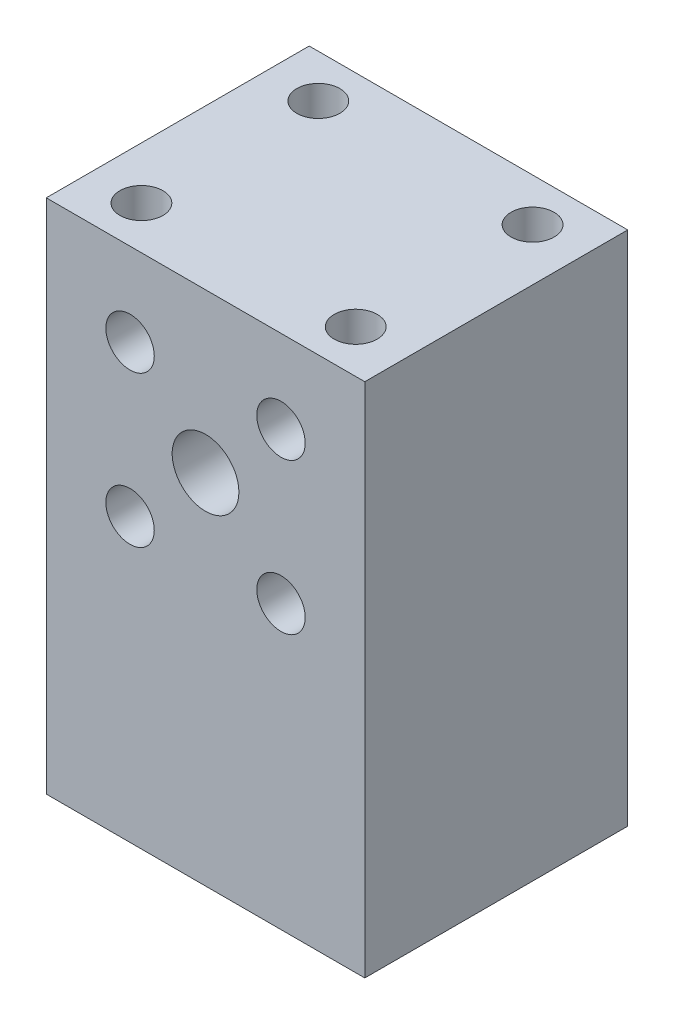
ISO-10303-21;
HEADER;
FILE_DESCRIPTION(('STEP AP214'),'2;1');
FILE_NAME('part.step','',(''),(''),'','','');
FILE_SCHEMA(('AUTOMOTIVE_DESIGN { 1 0 10303 214 1 1 1 1 }'));
ENDSEC;
DATA;
#1=APPLICATION_CONTEXT('core data for automotive mechanical design processes');
#2=APPLICATION_PROTOCOL_DEFINITION('international standard','automotive_design',2000,#1);
#3=PRODUCT_CONTEXT('',#1,'mechanical');
#4=PRODUCT('Part','Part','',(#3));
#5=PRODUCT_RELATED_PRODUCT_CATEGORY('part','',(#4));
#6=PRODUCT_DEFINITION_FORMATION('','',#4);
#7=PRODUCT_DEFINITION_CONTEXT('part definition',#1,'design');
#8=PRODUCT_DEFINITION('design','',#6,#7);
#9=PRODUCT_DEFINITION_SHAPE('','',#8);
#10=(LENGTH_UNIT() NAMED_UNIT(*) SI_UNIT(.MILLI.,.METRE.));
#11=(NAMED_UNIT(*) PLANE_ANGLE_UNIT() SI_UNIT($,.RADIAN.));
#12=(NAMED_UNIT(*) SI_UNIT($,.STERADIAN.) SOLID_ANGLE_UNIT());
#13=UNCERTAINTY_MEASURE_WITH_UNIT(LENGTH_MEASURE(1.E-05),#10,'distance_accuracy_value','');
#14=(GEOMETRIC_REPRESENTATION_CONTEXT(3) GLOBAL_UNCERTAINTY_ASSIGNED_CONTEXT((#13)) GLOBAL_UNIT_ASSIGNED_CONTEXT((#10,
#11,#12)) REPRESENTATION_CONTEXT('',''));
#15=CARTESIAN_POINT('',(0.,0.,0.));
#16=DIRECTION('',(0.,0.,1.));
#17=DIRECTION('',(1.,0.,0.));
#18=AXIS2_PLACEMENT_3D('',#15,#16,#17);
#19=CARTESIAN_POINT('',(23.4999999999754,52.8073925901338,-38.8000000000008));
#20=DIRECTION('',(0.,0.,1.));
#21=DIRECTION('',(1.,0.,0.));
#22=AXIS2_PLACEMENT_3D('',#19,#20,#21);
#23=CYLINDRICAL_SURFACE('',#22,4.92125);
#24=CARTESIAN_POINT('',(23.4999999999754,52.8073925901338,0.));
#25=DIRECTION('',(0.,0.,1.));
#26=DIRECTION('',(1.,0.,0.));
#27=AXIS2_PLACEMENT_3D('',#24,#25,#26);
#28=CIRCLE('',#27,4.92125);
#29=CARTESIAN_POINT('',(28.4212499999754,52.8073925901338,0.));
#30=VERTEX_POINT('',#29);
#31=EDGE_CURVE('E147',#30,#30,#28,.T.);
#32=ORIENTED_EDGE('',*,*,#31,.T.);
#33=EDGE_LOOP('',(#32));
#34=FACE_BOUND('',#33,.T.);
#35=CARTESIAN_POINT('',(23.4999999999754,52.8073925901338,-17.7814999999999));
#36=DIRECTION('',(0.,0.,-1.));
#37=DIRECTION('',(-1.,0.,0.));
#38=AXIS2_PLACEMENT_3D('',#35,#36,#37);
#39=CIRCLE('',#38,4.92125);
#40=CARTESIAN_POINT('',(18.5787499999754,52.8073925901338,-17.7814999999999));
#41=VERTEX_POINT('',#40);
#42=EDGE_CURVE('E44',#41,#41,#39,.F.);
#43=ORIENTED_EDGE('',*,*,#42,.F.);
#44=EDGE_LOOP('',(#43));
#45=FACE_BOUND('',#44,.T.);
#46=ADVANCED_FACE('F40',(#34,#45),#23,.F.);
#47=CARTESIAN_POINT('',(0.,76.2,0.));
#48=DIRECTION('',(1.,0.,0.));
#49=DIRECTION('',(0.,0.,-1.));
#50=AXIS2_PLACEMENT_3D('',#47,#48,#49);
#51=PLANE('',#50);
#52=DIRECTION('',(0.,0.,1.));
#53=VECTOR('',#52,1.);
#54=CARTESIAN_POINT('',(0.,0.,0.));
#55=LINE('',#54,#53);
#56=CARTESIAN_POINT('',(0.,0.,-38.7999999999999));
#57=VERTEX_POINT('',#56);
#58=CARTESIAN_POINT('',(0.,0.,0.));
#59=VERTEX_POINT('',#58);
#60=EDGE_CURVE('E111',#57,#59,#55,.T.);
#61=ORIENTED_EDGE('',*,*,#60,.T.);
#62=DIRECTION('',(0.,-1.,0.));
#63=VECTOR('',#62,1.);
#64=CARTESIAN_POINT('',(0.,76.2,0.));
#65=LINE('',#64,#63);
#66=CARTESIAN_POINT('',(0.,76.2,0.));
#67=VERTEX_POINT('',#66);
#68=EDGE_CURVE('E11',#67,#59,#65,.T.);
#69=ORIENTED_EDGE('',*,*,#68,.F.);
#70=DIRECTION('',(0.,0.,1.));
#71=VECTOR('',#70,1.);
#72=CARTESIAN_POINT('',(0.,76.2,0.));
#73=LINE('',#72,#71);
#74=CARTESIAN_POINT('',(0.,76.2,-38.7999999999999));
#75=VERTEX_POINT('',#74);
#76=EDGE_CURVE('E92',#75,#67,#73,.T.);
#77=ORIENTED_EDGE('',*,*,#76,.F.);
#78=DIRECTION('',(0.,-1.,0.));
#79=VECTOR('',#78,1.);
#80=CARTESIAN_POINT('',(0.,76.2,-38.7999999999999));
#81=LINE('',#80,#79);
#82=EDGE_CURVE('E59',#75,#57,#81,.T.);
#83=ORIENTED_EDGE('',*,*,#82,.T.);
#84=EDGE_LOOP('',(#61,#69,#77,#83));
#85=FACE_BOUND('',#84,.T.);
#86=ADVANCED_FACE('F42',(#85),#51,.F.);
#87=CARTESIAN_POINT('',(0.,76.2,0.));
#88=DIRECTION('',(0.,0.,-1.));
#89=DIRECTION('',(-1.,0.,0.));
#90=AXIS2_PLACEMENT_3D('',#87,#88,#89);
#91=PLANE('',#90);
#92=CARTESIAN_POINT('',(12.3644824098609,41.671875000008,0.));
#93=DIRECTION('',(0.,0.,1.));
#94=DIRECTION('',(1.,0.,0.));
#95=AXIS2_PLACEMENT_3D('',#92,#93,#94);
#96=CIRCLE('',#95,3.57187499999999);
#97=CARTESIAN_POINT('',(15.9363574098609,41.671875000008,0.));
#98=VERTEX_POINT('',#97);
#99=EDGE_CURVE('E138',#98,#98,#96,.T.);
#100=ORIENTED_EDGE('',*,*,#99,.F.);
#101=EDGE_LOOP('',(#100));
#102=FACE_BOUND('',#101,.T.);
#103=ORIENTED_EDGE('',*,*,#31,.F.);
#104=EDGE_LOOP('',(#103));
#105=FACE_BOUND('',#104,.T.);
#106=CARTESIAN_POINT('',(34.6355175900983,41.6718750000224,0.));
#107=DIRECTION('',(0.,0.,1.));
#108=DIRECTION('',(1.,0.,0.));
#109=AXIS2_PLACEMENT_3D('',#106,#107,#108);
#110=CIRCLE('',#109,3.57187500000001);
#111=CARTESIAN_POINT('',(38.2073925900983,41.6718750000224,0.));
#112=VERTEX_POINT('',#111);
#113=EDGE_CURVE('E151',#112,#112,#110,.T.);
#114=ORIENTED_EDGE('',*,*,#113,.F.);
#115=EDGE_LOOP('',(#114));
#116=FACE_BOUND('',#115,.T.);
#117=CARTESIAN_POINT('',(34.6355175900839,63.9429101802595,0.));
#118=DIRECTION('',(0.,0.,1.));
#119=DIRECTION('',(1.,0.,0.));
#120=AXIS2_PLACEMENT_3D('',#117,#118,#119);
#121=CIRCLE('',#120,3.57187499999999);
#122=CARTESIAN_POINT('',(38.2073925900839,63.9429101802595,0.));
#123=VERTEX_POINT('',#122);
#124=EDGE_CURVE('E159',#123,#123,#121,.T.);
#125=ORIENTED_EDGE('',*,*,#124,.F.);
#126=EDGE_LOOP('',(#125));
#127=FACE_BOUND('',#126,.T.);
#128=CARTESIAN_POINT('',(12.3644824098466,63.9429101802452,0.));
#129=DIRECTION('',(0.,0.,1.));
#130=DIRECTION('',(1.,0.,0.));
#131=AXIS2_PLACEMENT_3D('',#128,#129,#130);
#132=CIRCLE('',#131,3.57187500000001);
#133=CARTESIAN_POINT('',(15.9363574098466,63.9429101802452,0.));
#134=VERTEX_POINT('',#133);
#135=EDGE_CURVE('E130',#134,#134,#132,.T.);
#136=ORIENTED_EDGE('',*,*,#135,.F.);
#137=EDGE_LOOP('',(#136));
#138=FACE_BOUND('',#137,.T.);
#139=DIRECTION('',(1.,0.,0.));
#140=VECTOR('',#139,1.);
#141=CARTESIAN_POINT('',(0.,0.,0.));
#142=LINE('',#141,#140);
#143=CARTESIAN_POINT('',(47.0000000000011,0.,0.));
#144=VERTEX_POINT('',#143);
#145=EDGE_CURVE('E98',#59,#144,#142,.T.);
#146=ORIENTED_EDGE('',*,*,#145,.T.);
#147=DIRECTION('',(0.,-1.,0.));
#148=VECTOR('',#147,1.);
#149=CARTESIAN_POINT('',(47.0000000000011,76.2,0.));
#150=LINE('',#149,#148);
#151=CARTESIAN_POINT('',(47.0000000000011,76.2,0.));
#152=VERTEX_POINT('',#151);
#153=EDGE_CURVE('E51',#152,#144,#150,.T.);
#154=ORIENTED_EDGE('',*,*,#153,.F.);
#155=DIRECTION('',(1.,0.,0.));
#156=VECTOR('',#155,1.);
#157=CARTESIAN_POINT('',(0.,76.2,0.));
#158=LINE('',#157,#156);
#159=EDGE_CURVE('E85',#67,#152,#158,.T.);
#160=ORIENTED_EDGE('',*,*,#159,.F.);
#161=ORIENTED_EDGE('',*,*,#68,.T.);
#162=EDGE_LOOP('',(#146,#154,#160,#161));
#163=FACE_BOUND('',#162,.T.);
#164=ADVANCED_FACE('F97',(#102,#105,#116,#127,#138,#163),#91,.F.);
#165=CARTESIAN_POINT('',(47.0000000000011,76.2,0.));
#166=DIRECTION('',(-1.,0.,0.));
#167=DIRECTION('',(0.,0.,1.));
#168=AXIS2_PLACEMENT_3D('',#165,#166,#167);
#169=PLANE('',#168);
#170=DIRECTION('',(0.,0.,-1.));
#171=VECTOR('',#170,1.);
#172=CARTESIAN_POINT('',(47.0000000000011,0.,0.));
#173=LINE('',#172,#171);
#174=CARTESIAN_POINT('',(47.0000000000011,0.,-38.8000000000008));
#175=VERTEX_POINT('',#174);
#176=EDGE_CURVE('E117',#144,#175,#173,.T.);
#177=ORIENTED_EDGE('',*,*,#176,.T.);
#178=DIRECTION('',(0.,-1.,0.));
#179=VECTOR('',#178,1.);
#180=CARTESIAN_POINT('',(47.0000000000011,76.2,-38.8000000000008));
#181=LINE('',#180,#179);
#182=CARTESIAN_POINT('',(47.0000000000011,76.2,-38.8000000000008));
#183=VERTEX_POINT('',#182);
#184=EDGE_CURVE('E74',#183,#175,#181,.T.);
#185=ORIENTED_EDGE('',*,*,#184,.F.);
#186=DIRECTION('',(0.,0.,-1.));
#187=VECTOR('',#186,1.);
#188=CARTESIAN_POINT('',(47.0000000000011,76.2,0.));
#189=LINE('',#188,#187);
#190=EDGE_CURVE('E91',#152,#183,#189,.T.);
#191=ORIENTED_EDGE('',*,*,#190,.F.);
#192=ORIENTED_EDGE('',*,*,#153,.T.);
#193=EDGE_LOOP('',(#177,#185,#191,#192));
#194=FACE_BOUND('',#193,.T.);
#195=ADVANCED_FACE('F103',(#194),#169,.F.);
#196=CARTESIAN_POINT('',(0.,76.2,-38.7999999999999));
#197=DIRECTION('',(0.,0.,-1.));
#198=DIRECTION('',(-1.,0.,0.));
#199=AXIS2_PLACEMENT_3D('',#196,#197,#198);
#200=PLANE('',#199);
#201=CARTESIAN_POINT('',(23.4999999999754,52.8073925901338,-38.7999999999999));
#202=DIRECTION('',(0.,0.,-1.));
#203=DIRECTION('',(-1.,0.,0.));
#204=AXIS2_PLACEMENT_3D('',#201,#202,#203);
#205=CIRCLE('',#204,9.525);
#206=CARTESIAN_POINT('',(13.9749999999754,52.8073925901338,-38.7999999999999));
#207=VERTEX_POINT('',#206);
#208=EDGE_CURVE('E197',#207,#207,#205,.T.);
#209=ORIENTED_EDGE('',*,*,#208,.F.);
#210=EDGE_LOOP('',(#209));
#211=FACE_BOUND('',#210,.T.);
#212=CARTESIAN_POINT('',(12.3644824098609,41.671875000008,-38.8000000000008));
#213=DIRECTION('',(0.,0.,1.));
#214=DIRECTION('',(1.,0.,0.));
#215=AXIS2_PLACEMENT_3D('',#212,#213,#214);
#216=CIRCLE('',#215,3.57187499999999);
#217=CARTESIAN_POINT('',(15.9363574098609,41.671875000008,-38.8000000000008));
#218=VERTEX_POINT('',#217);
#219=EDGE_CURVE('E142',#218,#218,#216,.T.);
#220=ORIENTED_EDGE('',*,*,#219,.T.);
#221=EDGE_LOOP('',(#220));
#222=FACE_BOUND('',#221,.T.);
#223=CARTESIAN_POINT('',(34.6355175900983,41.6718750000224,-38.8000000000008));
#224=DIRECTION('',(0.,0.,1.));
#225=DIRECTION('',(1.,0.,0.));
#226=AXIS2_PLACEMENT_3D('',#223,#224,#225);
#227=CIRCLE('',#226,3.57187500000001);
#228=CARTESIAN_POINT('',(38.2073925900983,41.6718750000224,-38.8000000000008));
#229=VERTEX_POINT('',#228);
#230=EDGE_CURVE('E155',#229,#229,#227,.T.);
#231=ORIENTED_EDGE('',*,*,#230,.T.);
#232=EDGE_LOOP('',(#231));
#233=FACE_BOUND('',#232,.T.);
#234=CARTESIAN_POINT('',(34.6355175900839,63.9429101802595,-38.8000000000008));
#235=DIRECTION('',(0.,0.,1.));
#236=DIRECTION('',(1.,0.,0.));
#237=AXIS2_PLACEMENT_3D('',#234,#235,#236);
#238=CIRCLE('',#237,3.57187499999999);
#239=CARTESIAN_POINT('',(38.2073925900839,63.9429101802595,-38.8000000000008));
#240=VERTEX_POINT('',#239);
#241=EDGE_CURVE('E134',#240,#240,#238,.T.);
#242=ORIENTED_EDGE('',*,*,#241,.T.);
#243=EDGE_LOOP('',(#242));
#244=FACE_BOUND('',#243,.T.);
#245=CARTESIAN_POINT('',(12.3644824098466,63.9429101802452,-38.8000000000008));
#246=DIRECTION('',(0.,0.,1.));
#247=DIRECTION('',(1.,0.,0.));
#248=AXIS2_PLACEMENT_3D('',#245,#246,#247);
#249=CIRCLE('',#248,3.57187500000001);
#250=CARTESIAN_POINT('',(15.9363574098466,63.9429101802452,-38.8000000000008));
#251=VERTEX_POINT('',#250);
#252=EDGE_CURVE('E114',#251,#251,#249,.T.);
#253=ORIENTED_EDGE('',*,*,#252,.T.);
#254=EDGE_LOOP('',(#253));
#255=FACE_BOUND('',#254,.T.);
#256=DIRECTION('',(1.,0.,0.));
#257=VECTOR('',#256,1.);
#258=CARTESIAN_POINT('',(0.,0.,-38.7999999999999));
#259=LINE('',#258,#257);
#260=EDGE_CURVE('E120',#57,#175,#259,.T.);
#261=ORIENTED_EDGE('',*,*,#260,.F.);
#262=ORIENTED_EDGE('',*,*,#82,.F.);
#263=DIRECTION('',(1.,0.,0.));
#264=VECTOR('',#263,1.);
#265=CARTESIAN_POINT('',(0.,76.2,-38.7999999999999));
#266=LINE('',#265,#264);
#267=EDGE_CURVE('E105',#75,#183,#266,.T.);
#268=ORIENTED_EDGE('',*,*,#267,.T.);
#269=ORIENTED_EDGE('',*,*,#184,.T.);
#270=EDGE_LOOP('',(#261,#262,#268,#269));
#271=FACE_BOUND('',#270,.T.);
#272=ADVANCED_FACE('F250',(#211,#222,#233,#244,#255,#271),#200,.T.);
#273=CARTESIAN_POINT('',(0.,76.2,0.));
#274=DIRECTION('',(0.,1.,0.));
#275=DIRECTION('',(0.,0.,1.));
#276=AXIS2_PLACEMENT_3D('',#273,#274,#275);
#277=PLANE('',#276);
#278=CARTESIAN_POINT('',(7.69201030927855,76.2,-6.35));
#279=DIRECTION('',(0.,1.,0.));
#280=DIRECTION('',(0.,0.,1.));
#281=AXIS2_PLACEMENT_3D('',#278,#279,#280);
#282=CIRCLE('',#281,3.175);
#283=CARTESIAN_POINT('',(7.69201030927855,76.2,-3.175));
#284=VERTEX_POINT('',#283);
#285=EDGE_CURVE('E214',#284,#284,#282,.T.);
#286=ORIENTED_EDGE('',*,*,#285,.F.);
#287=EDGE_LOOP('',(#286));
#288=FACE_BOUND('',#287,.T.);
#289=CARTESIAN_POINT('',(39.3079896907225,76.2,-6.35));
#290=DIRECTION('',(0.,1.,0.));
#291=DIRECTION('',(0.,0.,1.));
#292=AXIS2_PLACEMENT_3D('',#289,#290,#291);
#293=CIRCLE('',#292,3.175);
#294=CARTESIAN_POINT('',(39.3079896907225,76.2,-3.175));
#295=VERTEX_POINT('',#294);
#296=EDGE_CURVE('E222',#295,#295,#293,.T.);
#297=ORIENTED_EDGE('',*,*,#296,.F.);
#298=EDGE_LOOP('',(#297));
#299=FACE_BOUND('',#298,.T.);
#300=CARTESIAN_POINT('',(39.3079896907225,76.2,-32.4499999999999));
#301=DIRECTION('',(0.,1.,0.));
#302=DIRECTION('',(0.,0.,1.));
#303=AXIS2_PLACEMENT_3D('',#300,#301,#302);
#304=CIRCLE('',#303,3.175);
#305=CARTESIAN_POINT('',(39.3079896907225,76.2,-29.2749999999999));
#306=VERTEX_POINT('',#305);
#307=EDGE_CURVE('E230',#306,#306,#304,.T.);
#308=ORIENTED_EDGE('',*,*,#307,.F.);
#309=EDGE_LOOP('',(#308));
#310=FACE_BOUND('',#309,.T.);
#311=CARTESIAN_POINT('',(7.69201030927855,76.2,-32.4499999999999));
#312=DIRECTION('',(0.,1.,0.));
#313=DIRECTION('',(0.,0.,1.));
#314=AXIS2_PLACEMENT_3D('',#311,#312,#313);
#315=CIRCLE('',#314,3.175);
#316=CARTESIAN_POINT('',(7.69201030927855,76.2,-29.2749999999999));
#317=VERTEX_POINT('',#316);
#318=EDGE_CURVE('E206',#317,#317,#315,.T.);
#319=ORIENTED_EDGE('',*,*,#318,.F.);
#320=EDGE_LOOP('',(#319));
#321=FACE_BOUND('',#320,.T.);
#322=ORIENTED_EDGE('',*,*,#76,.T.);
#323=ORIENTED_EDGE('',*,*,#159,.T.);
#324=ORIENTED_EDGE('',*,*,#190,.T.);
#325=ORIENTED_EDGE('',*,*,#267,.F.);
#326=EDGE_LOOP('',(#322,#323,#324,#325));
#327=FACE_BOUND('',#326,.T.);
#328=ADVANCED_FACE('F88',(#288,#299,#310,#321,#327),#277,.T.);
#329=CARTESIAN_POINT('',(0.,0.,0.));
#330=DIRECTION('',(0.,1.,0.));
#331=DIRECTION('',(0.,0.,1.));
#332=AXIS2_PLACEMENT_3D('',#329,#330,#331);
#333=PLANE('',#332);
#334=CARTESIAN_POINT('',(42.5,0.,-34.3999999999999));
#335=DIRECTION('',(0.,1.,0.));
#336=DIRECTION('',(0.,0.,1.));
#337=AXIS2_PLACEMENT_3D('',#334,#335,#336);
#338=CIRCLE('',#337,2.5);
#339=CARTESIAN_POINT('',(42.5,0.,-31.8999999999999));
#340=VERTEX_POINT('',#339);
#341=EDGE_CURVE('E174',#340,#340,#338,.T.);
#342=ORIENTED_EDGE('',*,*,#341,.T.);
#343=EDGE_LOOP('',(#342));
#344=FACE_BOUND('',#343,.T.);
#345=CARTESIAN_POINT('',(42.5,0.,-4.3999999999999));
#346=DIRECTION('',(0.,1.,0.));
#347=DIRECTION('',(0.,0.,1.));
#348=AXIS2_PLACEMENT_3D('',#345,#346,#347);
#349=CIRCLE('',#348,2.50000000000001);
#350=CARTESIAN_POINT('',(42.5,0.,-1.89999999999989));
#351=VERTEX_POINT('',#350);
#352=EDGE_CURVE('E182',#351,#351,#349,.T.);
#353=ORIENTED_EDGE('',*,*,#352,.T.);
#354=EDGE_LOOP('',(#353));
#355=FACE_BOUND('',#354,.T.);
#356=CARTESIAN_POINT('',(4.5,0.,-4.39999999999989));
#357=DIRECTION('',(0.,1.,0.));
#358=DIRECTION('',(0.,0.,1.));
#359=AXIS2_PLACEMENT_3D('',#356,#357,#358);
#360=CIRCLE('',#359,2.5);
#361=CARTESIAN_POINT('',(4.5,0.,-1.89999999999989));
#362=VERTEX_POINT('',#361);
#363=EDGE_CURVE('E190',#362,#362,#360,.T.);
#364=ORIENTED_EDGE('',*,*,#363,.T.);
#365=EDGE_LOOP('',(#364));
#366=FACE_BOUND('',#365,.T.);
#367=CARTESIAN_POINT('',(4.49999999999999,0.,-34.3999999999999));
#368=DIRECTION('',(0.,1.,0.));
#369=DIRECTION('',(0.,0.,1.));
#370=AXIS2_PLACEMENT_3D('',#367,#368,#369);
#371=CIRCLE('',#370,2.627);
#372=CARTESIAN_POINT('',(4.49999999999999,0.,-31.7729999999999));
#373=VERTEX_POINT('',#372);
#374=EDGE_CURVE('E166',#373,#373,#371,.T.);
#375=ORIENTED_EDGE('',*,*,#374,.T.);
#376=EDGE_LOOP('',(#375));
#377=FACE_BOUND('',#376,.T.);
#378=ORIENTED_EDGE('',*,*,#60,.F.);
#379=ORIENTED_EDGE('',*,*,#260,.T.);
#380=ORIENTED_EDGE('',*,*,#176,.F.);
#381=ORIENTED_EDGE('',*,*,#145,.F.);
#382=EDGE_LOOP('',(#378,#379,#380,#381));
#383=FACE_BOUND('',#382,.T.);
#384=ADVANCED_FACE('F249',(#344,#355,#366,#377,#383),#333,.F.);
#385=CARTESIAN_POINT('',(12.3644824098466,63.9429101802452,-38.8000000000008));
#386=DIRECTION('',(0.,0.,1.));
#387=DIRECTION('',(1.,0.,0.));
#388=AXIS2_PLACEMENT_3D('',#385,#386,#387);
#389=CYLINDRICAL_SURFACE('',#388,3.57187500000001);
#390=ORIENTED_EDGE('',*,*,#252,.F.);
#391=EDGE_LOOP('',(#390));
#392=FACE_BOUND('',#391,.T.);
#393=ORIENTED_EDGE('',*,*,#135,.T.);
#394=EDGE_LOOP('',(#393));
#395=FACE_BOUND('',#394,.T.);
#396=ADVANCED_FACE('F287',(#392,#395),#389,.F.);
#397=CARTESIAN_POINT('',(34.6355175900839,63.9429101802595,-38.8000000000008));
#398=DIRECTION('',(0.,0.,1.));
#399=DIRECTION('',(1.,0.,0.));
#400=AXIS2_PLACEMENT_3D('',#397,#398,#399);
#401=CYLINDRICAL_SURFACE('',#400,3.57187499999999);
#402=ORIENTED_EDGE('',*,*,#241,.F.);
#403=EDGE_LOOP('',(#402));
#404=FACE_BOUND('',#403,.T.);
#405=ORIENTED_EDGE('',*,*,#124,.T.);
#406=EDGE_LOOP('',(#405));
#407=FACE_BOUND('',#406,.T.);
#408=ADVANCED_FACE('F289',(#404,#407),#401,.F.);
#409=CARTESIAN_POINT('',(34.6355175900983,41.6718750000224,-38.8000000000008));
#410=DIRECTION('',(0.,0.,1.));
#411=DIRECTION('',(1.,0.,0.));
#412=AXIS2_PLACEMENT_3D('',#409,#410,#411);
#413=CYLINDRICAL_SURFACE('',#412,3.57187500000001);
#414=ORIENTED_EDGE('',*,*,#230,.F.);
#415=EDGE_LOOP('',(#414));
#416=FACE_BOUND('',#415,.T.);
#417=ORIENTED_EDGE('',*,*,#113,.T.);
#418=EDGE_LOOP('',(#417));
#419=FACE_BOUND('',#418,.T.);
#420=ADVANCED_FACE('F280',(#416,#419),#413,.F.);
#421=CARTESIAN_POINT('',(12.3644824098609,41.671875000008,-38.8000000000008));
#422=DIRECTION('',(0.,0.,1.));
#423=DIRECTION('',(1.,0.,0.));
#424=AXIS2_PLACEMENT_3D('',#421,#422,#423);
#425=CYLINDRICAL_SURFACE('',#424,3.57187499999999);
#426=ORIENTED_EDGE('',*,*,#219,.F.);
#427=EDGE_LOOP('',(#426));
#428=FACE_BOUND('',#427,.T.);
#429=ORIENTED_EDGE('',*,*,#99,.T.);
#430=EDGE_LOOP('',(#429));
#431=FACE_BOUND('',#430,.T.);
#432=ADVANCED_FACE('F282',(#428,#431),#425,.F.);
#433=CARTESIAN_POINT('',(4.49999999999999,38.1,-34.3999999999999));
#434=DIRECTION('',(0.,-1.,0.));
#435=DIRECTION('',(0.,0.,-1.));
#436=AXIS2_PLACEMENT_3D('',#433,#434,#435);
#437=CYLINDRICAL_SURFACE('',#436,2.627);
#438=CARTESIAN_POINT('',(4.49999999999999,38.1,-34.3999999999999));
#439=DIRECTION('',(0.,1.,0.));
#440=DIRECTION('',(0.,0.,1.));
#441=AXIS2_PLACEMENT_3D('',#438,#439,#440);
#442=CIRCLE('',#441,2.627);
#443=CARTESIAN_POINT('',(4.49999999999999,38.1,-31.7729999999999));
#444=VERTEX_POINT('',#443);
#445=EDGE_CURVE('E143',#444,#444,#442,.T.);
#446=ORIENTED_EDGE('',*,*,#445,.T.);
#447=EDGE_LOOP('',(#446));
#448=FACE_BOUND('',#447,.T.);
#449=ORIENTED_EDGE('',*,*,#374,.F.);
#450=EDGE_LOOP('',(#449));
#451=FACE_BOUND('',#450,.T.);
#452=ADVANCED_FACE('F285',(#448,#451),#437,.F.);
#453=CARTESIAN_POINT('',(0.,38.1,0.));
#454=DIRECTION('',(0.,1.,0.));
#455=DIRECTION('',(0.,0.,1.));
#456=AXIS2_PLACEMENT_3D('',#453,#454,#455);
#457=PLANE('',#456);
#458=ORIENTED_EDGE('',*,*,#445,.F.);
#459=EDGE_LOOP('',(#458));
#460=FACE_BOUND('',#459,.T.);
#461=ADVANCED_FACE('F324',(#460),#457,.F.);
#462=CARTESIAN_POINT('',(4.5,38.1,-4.39999999999989));
#463=DIRECTION('',(0.,-1.,0.));
#464=DIRECTION('',(0.,0.,-1.));
#465=AXIS2_PLACEMENT_3D('',#462,#463,#464);
#466=CYLINDRICAL_SURFACE('',#465,2.5);
#467=CARTESIAN_POINT('',(4.5,38.1,-4.39999999999989));
#468=DIRECTION('',(0.,1.,0.));
#469=DIRECTION('',(0.,0.,1.));
#470=AXIS2_PLACEMENT_3D('',#467,#468,#469);
#471=CIRCLE('',#470,2.5);
#472=CARTESIAN_POINT('',(4.5,38.1,-1.89999999999989));
#473=VERTEX_POINT('',#472);
#474=EDGE_CURVE('E170',#473,#473,#471,.T.);
#475=ORIENTED_EDGE('',*,*,#474,.T.);
#476=EDGE_LOOP('',(#475));
#477=FACE_BOUND('',#476,.T.);
#478=ORIENTED_EDGE('',*,*,#363,.F.);
#479=EDGE_LOOP('',(#478));
#480=FACE_BOUND('',#479,.T.);
#481=ADVANCED_FACE('F328',(#477,#480),#466,.F.);
#482=CARTESIAN_POINT('',(0.,38.1,0.));
#483=DIRECTION('',(0.,1.,0.));
#484=DIRECTION('',(0.,0.,1.));
#485=AXIS2_PLACEMENT_3D('',#482,#483,#484);
#486=PLANE('',#485);
#487=ORIENTED_EDGE('',*,*,#474,.F.);
#488=EDGE_LOOP('',(#487));
#489=FACE_BOUND('',#488,.T.);
#490=ADVANCED_FACE('F342',(#489),#486,.F.);
#491=CARTESIAN_POINT('',(42.5,38.1,-4.3999999999999));
#492=DIRECTION('',(0.,-1.,0.));
#493=DIRECTION('',(0.,0.,-1.));
#494=AXIS2_PLACEMENT_3D('',#491,#492,#493);
#495=CYLINDRICAL_SURFACE('',#494,2.50000000000001);
#496=CARTESIAN_POINT('',(42.5,38.1,-4.3999999999999));
#497=DIRECTION('',(0.,1.,0.));
#498=DIRECTION('',(0.,0.,1.));
#499=AXIS2_PLACEMENT_3D('',#496,#497,#498);
#500=CIRCLE('',#499,2.50000000000001);
#501=CARTESIAN_POINT('',(42.5,38.1,-1.89999999999989));
#502=VERTEX_POINT('',#501);
#503=EDGE_CURVE('E186',#502,#502,#500,.T.);
#504=ORIENTED_EDGE('',*,*,#503,.T.);
#505=EDGE_LOOP('',(#504));
#506=FACE_BOUND('',#505,.T.);
#507=ORIENTED_EDGE('',*,*,#352,.F.);
#508=EDGE_LOOP('',(#507));
#509=FACE_BOUND('',#508,.T.);
#510=ADVANCED_FACE('F339',(#506,#509),#495,.F.);
#511=CARTESIAN_POINT('',(0.,38.1,0.));
#512=DIRECTION('',(0.,1.,0.));
#513=DIRECTION('',(0.,0.,1.));
#514=AXIS2_PLACEMENT_3D('',#511,#512,#513);
#515=PLANE('',#514);
#516=ORIENTED_EDGE('',*,*,#503,.F.);
#517=EDGE_LOOP('',(#516));
#518=FACE_BOUND('',#517,.T.);
#519=ADVANCED_FACE('F334',(#518),#515,.F.);
#520=CARTESIAN_POINT('',(42.5,38.1,-34.3999999999999));
#521=DIRECTION('',(0.,-1.,0.));
#522=DIRECTION('',(0.,0.,-1.));
#523=AXIS2_PLACEMENT_3D('',#520,#521,#522);
#524=CYLINDRICAL_SURFACE('',#523,2.5);
#525=CARTESIAN_POINT('',(42.5,38.1,-34.3999999999999));
#526=DIRECTION('',(0.,1.,0.));
#527=DIRECTION('',(0.,0.,1.));
#528=AXIS2_PLACEMENT_3D('',#525,#526,#527);
#529=CIRCLE('',#528,2.5);
#530=CARTESIAN_POINT('',(42.5,38.1,-31.8999999999999));
#531=VERTEX_POINT('',#530);
#532=EDGE_CURVE('E178',#531,#531,#529,.T.);
#533=ORIENTED_EDGE('',*,*,#532,.T.);
#534=EDGE_LOOP('',(#533));
#535=FACE_BOUND('',#534,.T.);
#536=ORIENTED_EDGE('',*,*,#341,.F.);
#537=EDGE_LOOP('',(#536));
#538=FACE_BOUND('',#537,.T.);
#539=ADVANCED_FACE('F330',(#535,#538),#524,.F.);
#540=CARTESIAN_POINT('',(0.,38.1,0.));
#541=DIRECTION('',(0.,1.,0.));
#542=DIRECTION('',(0.,0.,1.));
#543=AXIS2_PLACEMENT_3D('',#540,#541,#542);
#544=PLANE('',#543);
#545=ORIENTED_EDGE('',*,*,#532,.F.);
#546=EDGE_LOOP('',(#545));
#547=FACE_BOUND('',#546,.T.);
#548=ADVANCED_FACE('F333',(#547),#544,.F.);
#549=CARTESIAN_POINT('',(23.4999999999754,52.8073925901338,-17.7814999999999));
#550=DIRECTION('',(0.,0.,-1.));
#551=DIRECTION('',(-1.,0.,0.));
#552=AXIS2_PLACEMENT_3D('',#549,#550,#551);
#553=PLANE('',#552);
#554=CARTESIAN_POINT('',(23.4999999999754,52.8073925901338,-17.7814999999999));
#555=DIRECTION('',(0.,0.,-1.));
#556=DIRECTION('',(-1.,0.,0.));
#557=AXIS2_PLACEMENT_3D('',#554,#555,#556);
#558=CIRCLE('',#557,9.525);
#559=CARTESIAN_POINT('',(13.9749999999754,52.8073925901338,-17.7814999999999));
#560=VERTEX_POINT('',#559);
#561=EDGE_CURVE('E201',#560,#560,#558,.T.);
#562=ORIENTED_EDGE('',*,*,#561,.T.);
#563=EDGE_LOOP('',(#562));
#564=FACE_BOUND('',#563,.T.);
#565=ORIENTED_EDGE('',*,*,#42,.T.);
#566=EDGE_LOOP('',(#565));
#567=FACE_BOUND('',#566,.T.);
#568=ADVANCED_FACE('F266',(#564,#567),#553,.T.);
#569=CARTESIAN_POINT('',(23.4999999999754,52.8073925901338,-17.7814999999999));
#570=DIRECTION('',(0.,0.,-1.));
#571=DIRECTION('',(-1.,0.,0.));
#572=AXIS2_PLACEMENT_3D('',#569,#570,#571);
#573=CYLINDRICAL_SURFACE('',#572,9.525);
#574=ORIENTED_EDGE('',*,*,#561,.F.);
#575=EDGE_LOOP('',(#574));
#576=FACE_BOUND('',#575,.T.);
#577=ORIENTED_EDGE('',*,*,#208,.T.);
#578=EDGE_LOOP('',(#577));
#579=FACE_BOUND('',#578,.T.);
#580=ADVANCED_FACE('F257',(#576,#579),#573,.F.);
#581=CARTESIAN_POINT('',(7.69201030927855,69.85,-32.4499999999999));
#582=DIRECTION('',(0.,1.,0.));
#583=DIRECTION('',(0.,0.,1.));
#584=AXIS2_PLACEMENT_3D('',#581,#582,#583);
#585=CYLINDRICAL_SURFACE('',#584,3.175);
#586=CARTESIAN_POINT('',(7.69201030927855,69.85,-32.4499999999999));
#587=DIRECTION('',(0.,1.,0.));
#588=DIRECTION('',(0.,0.,1.));
#589=AXIS2_PLACEMENT_3D('',#586,#587,#588);
#590=CIRCLE('',#589,3.175);
#591=CARTESIAN_POINT('',(7.69201030927855,69.85,-29.2749999999999));
#592=VERTEX_POINT('',#591);
#593=EDGE_CURVE('E202',#592,#592,#590,.T.);
#594=ORIENTED_EDGE('',*,*,#593,.F.);
#595=EDGE_LOOP('',(#594));
#596=FACE_BOUND('',#595,.T.);
#597=ORIENTED_EDGE('',*,*,#318,.T.);
#598=EDGE_LOOP('',(#597));
#599=FACE_BOUND('',#598,.T.);
#600=ADVANCED_FACE('F255',(#596,#599),#585,.F.);
#601=CARTESIAN_POINT('',(7.69201030927855,69.85,-32.4499999999999));
#602=DIRECTION('',(0.,1.,0.));
#603=DIRECTION('',(0.,0.,1.));
#604=AXIS2_PLACEMENT_3D('',#601,#602,#603);
#605=PLANE('',#604);
#606=ORIENTED_EDGE('',*,*,#593,.T.);
#607=EDGE_LOOP('',(#606));
#608=FACE_BOUND('',#607,.T.);
#609=ADVANCED_FACE('F243',(#608),#605,.T.);
#610=CARTESIAN_POINT('',(39.3079896907225,69.85,-32.4499999999999));
#611=DIRECTION('',(0.,1.,0.));
#612=DIRECTION('',(0.,0.,1.));
#613=AXIS2_PLACEMENT_3D('',#610,#611,#612);
#614=CYLINDRICAL_SURFACE('',#613,3.175);
#615=CARTESIAN_POINT('',(39.3079896907225,69.85,-32.4499999999999));
#616=DIRECTION('',(0.,1.,0.));
#617=DIRECTION('',(0.,0.,1.));
#618=AXIS2_PLACEMENT_3D('',#615,#616,#617);
#619=CIRCLE('',#618,3.175);
#620=CARTESIAN_POINT('',(39.3079896907225,69.85,-29.2749999999999));
#621=VERTEX_POINT('',#620);
#622=EDGE_CURVE('E210',#621,#621,#619,.T.);
#623=ORIENTED_EDGE('',*,*,#622,.F.);
#624=EDGE_LOOP('',(#623));
#625=FACE_BOUND('',#624,.T.);
#626=ORIENTED_EDGE('',*,*,#307,.T.);
#627=EDGE_LOOP('',(#626));
#628=FACE_BOUND('',#627,.T.);
#629=ADVANCED_FACE('F240',(#625,#628),#614,.F.);
#630=CARTESIAN_POINT('',(39.3079896907225,69.85,-32.4499999999999));
#631=DIRECTION('',(0.,1.,0.));
#632=DIRECTION('',(0.,0.,1.));
#633=AXIS2_PLACEMENT_3D('',#630,#631,#632);
#634=PLANE('',#633);
#635=ORIENTED_EDGE('',*,*,#622,.T.);
#636=EDGE_LOOP('',(#635));
#637=FACE_BOUND('',#636,.T.);
#638=ADVANCED_FACE('F238',(#637),#634,.T.);
#639=CARTESIAN_POINT('',(39.3079896907225,69.85,-6.35));
#640=DIRECTION('',(0.,1.,0.));
#641=DIRECTION('',(0.,0.,1.));
#642=AXIS2_PLACEMENT_3D('',#639,#640,#641);
#643=CYLINDRICAL_SURFACE('',#642,3.175);
#644=CARTESIAN_POINT('',(39.3079896907225,69.85,-6.35));
#645=DIRECTION('',(0.,1.,0.));
#646=DIRECTION('',(0.,0.,1.));
#647=AXIS2_PLACEMENT_3D('',#644,#645,#646);
#648=CIRCLE('',#647,3.175);
#649=CARTESIAN_POINT('',(39.3079896907225,69.85,-3.175));
#650=VERTEX_POINT('',#649);
#651=EDGE_CURVE('E226',#650,#650,#648,.T.);
#652=ORIENTED_EDGE('',*,*,#651,.F.);
#653=EDGE_LOOP('',(#652));
#654=FACE_BOUND('',#653,.T.);
#655=ORIENTED_EDGE('',*,*,#296,.T.);
#656=EDGE_LOOP('',(#655));
#657=FACE_BOUND('',#656,.T.);
#658=ADVANCED_FACE('F408',(#654,#657),#643,.F.);
#659=CARTESIAN_POINT('',(39.3079896907225,69.85,-6.35));
#660=DIRECTION('',(0.,1.,0.));
#661=DIRECTION('',(0.,0.,1.));
#662=AXIS2_PLACEMENT_3D('',#659,#660,#661);
#663=PLANE('',#662);
#664=ORIENTED_EDGE('',*,*,#651,.T.);
#665=EDGE_LOOP('',(#664));
#666=FACE_BOUND('',#665,.T.);
#667=ADVANCED_FACE('F417',(#666),#663,.T.);
#668=CARTESIAN_POINT('',(7.69201030927855,69.85,-6.35));
#669=DIRECTION('',(0.,1.,0.));
#670=DIRECTION('',(0.,0.,1.));
#671=AXIS2_PLACEMENT_3D('',#668,#669,#670);
#672=CYLINDRICAL_SURFACE('',#671,3.175);
#673=CARTESIAN_POINT('',(7.69201030927855,69.85,-6.35));
#674=DIRECTION('',(0.,1.,0.));
#675=DIRECTION('',(0.,0.,1.));
#676=AXIS2_PLACEMENT_3D('',#673,#674,#675);
#677=CIRCLE('',#676,3.175);
#678=CARTESIAN_POINT('',(7.69201030927855,69.85,-3.175));
#679=VERTEX_POINT('',#678);
#680=EDGE_CURVE('E218',#679,#679,#677,.T.);
#681=ORIENTED_EDGE('',*,*,#680,.F.);
#682=EDGE_LOOP('',(#681));
#683=FACE_BOUND('',#682,.T.);
#684=ORIENTED_EDGE('',*,*,#285,.T.);
#685=EDGE_LOOP('',(#684));
#686=FACE_BOUND('',#685,.T.);
#687=ADVANCED_FACE('F427',(#683,#686),#672,.F.);
#688=CARTESIAN_POINT('',(7.69201030927855,69.85,-6.35));
#689=DIRECTION('',(0.,1.,0.));
#690=DIRECTION('',(0.,0.,1.));
#691=AXIS2_PLACEMENT_3D('',#688,#689,#690);
#692=PLANE('',#691);
#693=ORIENTED_EDGE('',*,*,#680,.T.);
#694=EDGE_LOOP('',(#693));
#695=FACE_BOUND('',#694,.T.);
#696=ADVANCED_FACE('F437',(#695),#692,.T.);
#697=CLOSED_SHELL('',(#46,#86,#164,#195,#272,#328,#384,#396,#408,#420,#432,#452,#461,#481,#490,
#510,#519,#539,#548,#568,#580,#600,#609,#629,#638,#658,#667,#687,#696));
#698=MANIFOLD_SOLID_BREP('B2',#697);
#699=ADVANCED_BREP_SHAPE_REPRESENTATION('',(#18,#698),#14);
#700=SHAPE_DEFINITION_REPRESENTATION(#9,#699);
ENDSEC;
END-ISO-10303-21;
